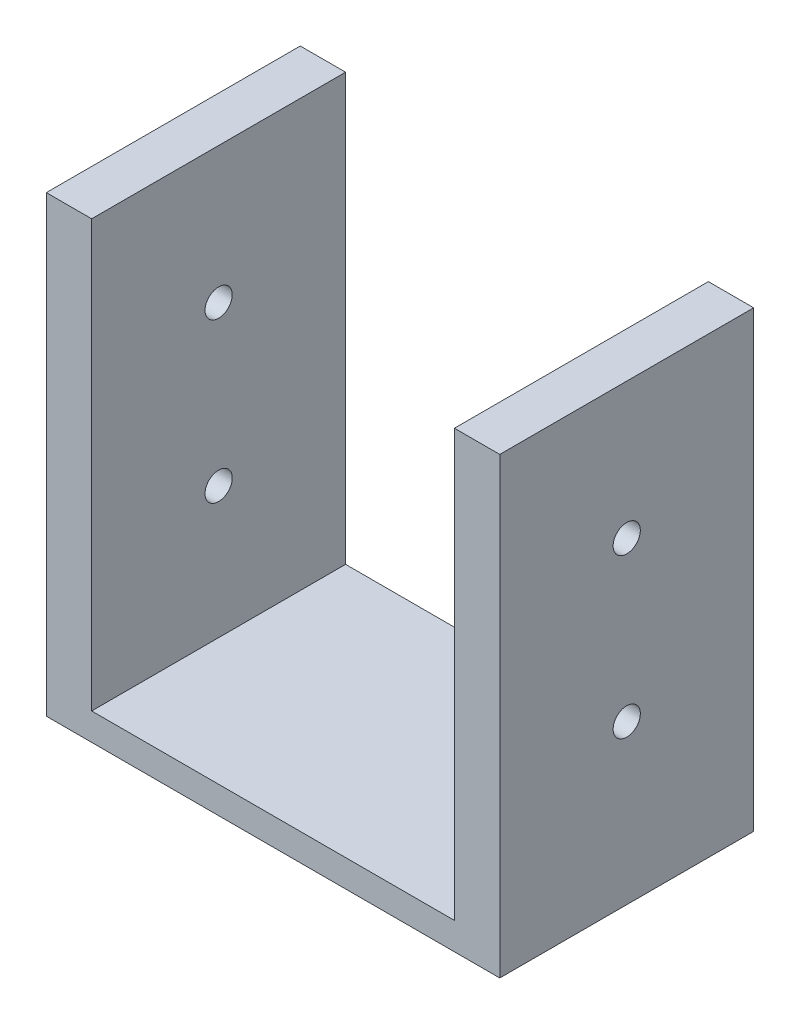
ISO-10303-21;
HEADER;
FILE_DESCRIPTION(('STEP AP214'),'2;1');
FILE_NAME('part.step','',(''),(''),'','','');
FILE_SCHEMA(('AUTOMOTIVE_DESIGN { 1 0 10303 214 1 1 1 1 }'));
ENDSEC;
DATA;
#1=APPLICATION_CONTEXT('core data for automotive mechanical design processes');
#2=APPLICATION_PROTOCOL_DEFINITION('international standard','automotive_design',2000,#1);
#3=PRODUCT_CONTEXT('',#1,'mechanical');
#4=PRODUCT('Part','Part','',(#3));
#5=PRODUCT_RELATED_PRODUCT_CATEGORY('part','',(#4));
#6=PRODUCT_DEFINITION_FORMATION('','',#4);
#7=PRODUCT_DEFINITION_CONTEXT('part definition',#1,'design');
#8=PRODUCT_DEFINITION('design','',#6,#7);
#9=PRODUCT_DEFINITION_SHAPE('','',#8);
#10=(LENGTH_UNIT() NAMED_UNIT(*) SI_UNIT(.MILLI.,.METRE.));
#11=(NAMED_UNIT(*) PLANE_ANGLE_UNIT() SI_UNIT($,.RADIAN.));
#12=(NAMED_UNIT(*) SI_UNIT($,.STERADIAN.) SOLID_ANGLE_UNIT());
#13=UNCERTAINTY_MEASURE_WITH_UNIT(LENGTH_MEASURE(1.E-05),#10,'distance_accuracy_value','');
#14=(GEOMETRIC_REPRESENTATION_CONTEXT(3) GLOBAL_UNCERTAINTY_ASSIGNED_CONTEXT((#13)) GLOBAL_UNIT_ASSIGNED_CONTEXT((#10,
#11,#12)) REPRESENTATION_CONTEXT('',''));
#15=CARTESIAN_POINT('',(0.,0.,0.));
#16=DIRECTION('',(0.,0.,1.));
#17=DIRECTION('',(1.,0.,0.));
#18=AXIS2_PLACEMENT_3D('',#15,#16,#17);
#19=CARTESIAN_POINT('',(0.,3.,0.));
#20=DIRECTION('',(0.,1.,0.));
#21=DIRECTION('',(0.,0.,1.));
#22=AXIS2_PLACEMENT_3D('',#19,#20,#21);
#23=PLANE('',#22);
#24=DIRECTION('',(1.,0.,0.));
#25=VECTOR('',#24,1.);
#26=CARTESIAN_POINT('',(0.,3.,14.));
#27=LINE('',#26,#25);
#28=CARTESIAN_POINT('',(-20.,3.,14.));
#29=VERTEX_POINT('',#28);
#30=CARTESIAN_POINT('',(20.,3.,14.));
#31=VERTEX_POINT('',#30);
#32=EDGE_CURVE('E67',#29,#31,#27,.T.);
#33=ORIENTED_EDGE('',*,*,#32,.T.);
#34=DIRECTION('',(0.,0.,1.));
#35=VECTOR('',#34,1.);
#36=CARTESIAN_POINT('',(20.,3.,14.));
#37=LINE('',#36,#35);
#38=CARTESIAN_POINT('',(20.,3.,-14.));
#39=VERTEX_POINT('',#38);
#40=EDGE_CURVE('E62',#39,#31,#37,.T.);
#41=ORIENTED_EDGE('',*,*,#40,.F.);
#42=DIRECTION('',(1.,0.,0.));
#43=VECTOR('',#42,1.);
#44=CARTESIAN_POINT('',(0.,3.,-14.));
#45=LINE('',#44,#43);
#46=CARTESIAN_POINT('',(-20.,3.,-14.));
#47=VERTEX_POINT('',#46);
#48=EDGE_CURVE('E168',#47,#39,#45,.T.);
#49=ORIENTED_EDGE('',*,*,#48,.F.);
#50=DIRECTION('',(0.,0.,-1.));
#51=VECTOR('',#50,1.);
#52=CARTESIAN_POINT('',(-20.,3.,-14.));
#53=LINE('',#52,#51);
#54=EDGE_CURVE('E136',#29,#47,#53,.T.);
#55=ORIENTED_EDGE('',*,*,#54,.F.);
#56=EDGE_LOOP('',(#33,#41,#49,#55));
#57=FACE_BOUND('',#56,.T.);
#58=ADVANCED_FACE('F44',(#57),#23,.T.);
#59=CARTESIAN_POINT('',(0.,3.,14.));
#60=DIRECTION('',(0.,0.,-1.));
#61=DIRECTION('',(-1.,0.,0.));
#62=AXIS2_PLACEMENT_3D('',#59,#60,#61);
#63=PLANE('',#62);
#64=DIRECTION('',(1.,0.,0.));
#65=VECTOR('',#64,1.);
#66=CARTESIAN_POINT('',(0.,0.,14.));
#67=LINE('',#66,#65);
#68=CARTESIAN_POINT('',(-25.,0.,14.));
#69=VERTEX_POINT('',#68);
#70=CARTESIAN_POINT('',(25.,0.,14.));
#71=VERTEX_POINT('',#70);
#72=EDGE_CURVE('E114',#69,#71,#67,.T.);
#73=ORIENTED_EDGE('',*,*,#72,.T.);
#74=DIRECTION('',(0.,-1.,0.));
#75=VECTOR('',#74,1.);
#76=CARTESIAN_POINT('',(25.,3.,14.));
#77=LINE('',#76,#75);
#78=CARTESIAN_POINT('',(25.,50.,14.));
#79=VERTEX_POINT('',#78);
#80=EDGE_CURVE('E11',#79,#71,#77,.T.);
#81=ORIENTED_EDGE('',*,*,#80,.F.);
#82=DIRECTION('',(1.,0.,0.));
#83=VECTOR('',#82,1.);
#84=CARTESIAN_POINT('',(25.,50.,14.));
#85=LINE('',#84,#83);
#86=CARTESIAN_POINT('',(20.,50.,14.));
#87=VERTEX_POINT('',#86);
#88=EDGE_CURVE('E111',#87,#79,#85,.T.);
#89=ORIENTED_EDGE('',*,*,#88,.F.);
#90=DIRECTION('',(0.,-1.,0.));
#91=VECTOR('',#90,1.);
#92=CARTESIAN_POINT('',(20.,50.,14.));
#93=LINE('',#92,#91);
#94=EDGE_CURVE('E127',#87,#31,#93,.T.);
#95=ORIENTED_EDGE('',*,*,#94,.T.);
#96=ORIENTED_EDGE('',*,*,#32,.F.);
#97=DIRECTION('',(0.,-1.,0.));
#98=VECTOR('',#97,1.);
#99=CARTESIAN_POINT('',(-20.,50.,14.));
#100=LINE('',#99,#98);
#101=CARTESIAN_POINT('',(-20.,50.,14.));
#102=VERTEX_POINT('',#101);
#103=EDGE_CURVE('E162',#102,#29,#100,.T.);
#104=ORIENTED_EDGE('',*,*,#103,.F.);
#105=DIRECTION('',(1.,0.,0.));
#106=VECTOR('',#105,1.);
#107=CARTESIAN_POINT('',(-25.,50.,14.));
#108=LINE('',#107,#106);
#109=CARTESIAN_POINT('',(-25.,50.,14.));
#110=VERTEX_POINT('',#109);
#111=EDGE_CURVE('E145',#110,#102,#108,.T.);
#112=ORIENTED_EDGE('',*,*,#111,.F.);
#113=DIRECTION('',(0.,-1.,0.));
#114=VECTOR('',#113,1.);
#115=CARTESIAN_POINT('',(-25.,3.,14.));
#116=LINE('',#115,#114);
#117=EDGE_CURVE('E172',#110,#69,#116,.T.);
#118=ORIENTED_EDGE('',*,*,#117,.T.);
#119=EDGE_LOOP('',(#73,#81,#89,#95,#96,#104,#112,#118));
#120=FACE_BOUND('',#119,.T.);
#121=ADVANCED_FACE('F46',(#120),#63,.F.);
#122=CARTESIAN_POINT('',(25.,3.,0.));
#123=DIRECTION('',(1.,0.,0.));
#124=DIRECTION('',(0.,0.,-1.));
#125=AXIS2_PLACEMENT_3D('',#122,#123,#124);
#126=PLANE('',#125);
#127=CARTESIAN_POINT('',(25.,17.5,0.));
#128=DIRECTION('',(1.,0.,0.));
#129=DIRECTION('',(0.,0.,-1.));
#130=AXIS2_PLACEMENT_3D('',#127,#128,#129);
#131=CIRCLE('',#130,1.5);
#132=CARTESIAN_POINT('',(25.,17.5,-1.50000000000001));
#133=VERTEX_POINT('',#132);
#134=EDGE_CURVE('E202',#133,#133,#131,.T.);
#135=ORIENTED_EDGE('',*,*,#134,.F.);
#136=EDGE_LOOP('',(#135));
#137=FACE_BOUND('',#136,.T.);
#138=CARTESIAN_POINT('',(25.,35.,0.));
#139=DIRECTION('',(1.,0.,0.));
#140=DIRECTION('',(0.,0.,-1.));
#141=AXIS2_PLACEMENT_3D('',#138,#139,#140);
#142=CIRCLE('',#141,1.5);
#143=CARTESIAN_POINT('',(25.,35.,-1.50000000000001));
#144=VERTEX_POINT('',#143);
#145=EDGE_CURVE('E208',#144,#144,#142,.T.);
#146=ORIENTED_EDGE('',*,*,#145,.F.);
#147=EDGE_LOOP('',(#146));
#148=FACE_BOUND('',#147,.T.);
#149=DIRECTION('',(0.,0.,1.));
#150=VECTOR('',#149,1.);
#151=CARTESIAN_POINT('',(25.,0.,0.));
#152=LINE('',#151,#150);
#153=CARTESIAN_POINT('',(25.,0.,-14.));
#154=VERTEX_POINT('',#153);
#155=EDGE_CURVE('E175',#154,#71,#152,.T.);
#156=ORIENTED_EDGE('',*,*,#155,.F.);
#157=DIRECTION('',(0.,-1.,0.));
#158=VECTOR('',#157,1.);
#159=CARTESIAN_POINT('',(25.,3.,-14.));
#160=LINE('',#159,#158);
#161=CARTESIAN_POINT('',(25.,50.,-14.));
#162=VERTEX_POINT('',#161);
#163=EDGE_CURVE('E54',#162,#154,#160,.T.);
#164=ORIENTED_EDGE('',*,*,#163,.F.);
#165=DIRECTION('',(0.,0.,-1.));
#166=VECTOR('',#165,1.);
#167=CARTESIAN_POINT('',(25.,50.,14.));
#168=LINE('',#167,#166);
#169=EDGE_CURVE('E122',#79,#162,#168,.T.);
#170=ORIENTED_EDGE('',*,*,#169,.F.);
#171=ORIENTED_EDGE('',*,*,#80,.T.);
#172=EDGE_LOOP('',(#156,#164,#170,#171));
#173=FACE_BOUND('',#172,.T.);
#174=ADVANCED_FACE('F129',(#137,#148,#173),#126,.T.);
#175=CARTESIAN_POINT('',(0.,3.,-14.));
#176=DIRECTION('',(0.,0.,-1.));
#177=DIRECTION('',(-1.,0.,0.));
#178=AXIS2_PLACEMENT_3D('',#175,#176,#177);
#179=PLANE('',#178);
#180=DIRECTION('',(1.,0.,0.));
#181=VECTOR('',#180,1.);
#182=CARTESIAN_POINT('',(0.,0.,-14.));
#183=LINE('',#182,#181);
#184=CARTESIAN_POINT('',(-25.,0.,-14.));
#185=VERTEX_POINT('',#184);
#186=EDGE_CURVE('E178',#185,#154,#183,.T.);
#187=ORIENTED_EDGE('',*,*,#186,.F.);
#188=DIRECTION('',(0.,-1.,0.));
#189=VECTOR('',#188,1.);
#190=CARTESIAN_POINT('',(-25.,3.,-14.));
#191=LINE('',#190,#189);
#192=CARTESIAN_POINT('',(-25.,50.,-14.));
#193=VERTEX_POINT('',#192);
#194=EDGE_CURVE('E186',#193,#185,#191,.T.);
#195=ORIENTED_EDGE('',*,*,#194,.F.);
#196=DIRECTION('',(-1.,0.,0.));
#197=VECTOR('',#196,1.);
#198=CARTESIAN_POINT('',(-25.,50.,-14.));
#199=LINE('',#198,#197);
#200=CARTESIAN_POINT('',(-20.,50.,-14.));
#201=VERTEX_POINT('',#200);
#202=EDGE_CURVE('E151',#201,#193,#199,.T.);
#203=ORIENTED_EDGE('',*,*,#202,.F.);
#204=DIRECTION('',(0.,-1.,0.));
#205=VECTOR('',#204,1.);
#206=CARTESIAN_POINT('',(-20.,50.,-14.));
#207=LINE('',#206,#205);
#208=EDGE_CURVE('E155',#201,#47,#207,.T.);
#209=ORIENTED_EDGE('',*,*,#208,.T.);
#210=ORIENTED_EDGE('',*,*,#48,.T.);
#211=DIRECTION('',(0.,-1.,0.));
#212=VECTOR('',#211,1.);
#213=CARTESIAN_POINT('',(20.,50.,-14.));
#214=LINE('',#213,#212);
#215=CARTESIAN_POINT('',(20.,50.,-14.));
#216=VERTEX_POINT('',#215);
#217=EDGE_CURVE('E222',#216,#39,#214,.T.);
#218=ORIENTED_EDGE('',*,*,#217,.F.);
#219=DIRECTION('',(-1.,0.,0.));
#220=VECTOR('',#219,1.);
#221=CARTESIAN_POINT('',(25.,50.,-14.));
#222=LINE('',#221,#220);
#223=EDGE_CURVE('E132',#162,#216,#222,.T.);
#224=ORIENTED_EDGE('',*,*,#223,.F.);
#225=ORIENTED_EDGE('',*,*,#163,.T.);
#226=EDGE_LOOP('',(#187,#195,#203,#209,#210,#218,#224,#225));
#227=FACE_BOUND('',#226,.T.);
#228=ADVANCED_FACE('F266',(#227),#179,.T.);
#229=CARTESIAN_POINT('',(-25.,3.,0.));
#230=DIRECTION('',(1.,0.,0.));
#231=DIRECTION('',(0.,0.,-1.));
#232=AXIS2_PLACEMENT_3D('',#229,#230,#231);
#233=PLANE('',#232);
#234=CARTESIAN_POINT('',(-25.,17.5,0.));
#235=DIRECTION('',(1.,0.,0.));
#236=DIRECTION('',(0.,0.,-1.));
#237=AXIS2_PLACEMENT_3D('',#234,#235,#236);
#238=CIRCLE('',#237,1.5);
#239=CARTESIAN_POINT('',(-25.,17.5,-1.5));
#240=VERTEX_POINT('',#239);
#241=EDGE_CURVE('E194',#240,#240,#238,.T.);
#242=ORIENTED_EDGE('',*,*,#241,.T.);
#243=EDGE_LOOP('',(#242));
#244=FACE_BOUND('',#243,.T.);
#245=CARTESIAN_POINT('',(-25.,35.,0.));
#246=DIRECTION('',(1.,0.,0.));
#247=DIRECTION('',(0.,0.,-1.));
#248=AXIS2_PLACEMENT_3D('',#245,#246,#247);
#249=CIRCLE('',#248,1.5);
#250=CARTESIAN_POINT('',(-25.,35.,-1.49999999999999));
#251=VERTEX_POINT('',#250);
#252=EDGE_CURVE('E214',#251,#251,#249,.T.);
#253=ORIENTED_EDGE('',*,*,#252,.T.);
#254=EDGE_LOOP('',(#253));
#255=FACE_BOUND('',#254,.T.);
#256=DIRECTION('',(0.,0.,1.));
#257=VECTOR('',#256,1.);
#258=CARTESIAN_POINT('',(-25.,0.,0.));
#259=LINE('',#258,#257);
#260=EDGE_CURVE('E169',#185,#69,#259,.T.);
#261=ORIENTED_EDGE('',*,*,#260,.T.);
#262=ORIENTED_EDGE('',*,*,#117,.F.);
#263=DIRECTION('',(0.,0.,1.));
#264=VECTOR('',#263,1.);
#265=CARTESIAN_POINT('',(-25.,50.,-14.));
#266=LINE('',#265,#264);
#267=EDGE_CURVE('E141',#193,#110,#266,.T.);
#268=ORIENTED_EDGE('',*,*,#267,.F.);
#269=ORIENTED_EDGE('',*,*,#194,.T.);
#270=EDGE_LOOP('',(#261,#262,#268,#269));
#271=FACE_BOUND('',#270,.T.);
#272=ADVANCED_FACE('F262',(#244,#255,#271),#233,.F.);
#273=CARTESIAN_POINT('',(0.,0.,0.));
#274=DIRECTION('',(0.,1.,0.));
#275=DIRECTION('',(0.,0.,1.));
#276=AXIS2_PLACEMENT_3D('',#273,#274,#275);
#277=PLANE('',#276);
#278=ORIENTED_EDGE('',*,*,#72,.F.);
#279=ORIENTED_EDGE('',*,*,#260,.F.);
#280=ORIENTED_EDGE('',*,*,#186,.T.);
#281=ORIENTED_EDGE('',*,*,#155,.T.);
#282=EDGE_LOOP('',(#278,#279,#280,#281));
#283=FACE_BOUND('',#282,.T.);
#284=ADVANCED_FACE('F259',(#283),#277,.F.);
#285=CARTESIAN_POINT('',(-20.,50.,-14.));
#286=DIRECTION('',(-1.,0.,0.));
#287=DIRECTION('',(0.,0.,1.));
#288=AXIS2_PLACEMENT_3D('',#285,#286,#287);
#289=PLANE('',#288);
#290=CARTESIAN_POINT('',(-20.,17.5,0.));
#291=DIRECTION('',(-1.,0.,0.));
#292=DIRECTION('',(0.,0.,1.));
#293=AXIS2_PLACEMENT_3D('',#290,#291,#292);
#294=CIRCLE('',#293,1.5);
#295=CARTESIAN_POINT('',(-20.,17.5,1.50000000000001));
#296=VERTEX_POINT('',#295);
#297=EDGE_CURVE('E218',#296,#296,#294,.T.);
#298=ORIENTED_EDGE('',*,*,#297,.T.);
#299=EDGE_LOOP('',(#298));
#300=FACE_BOUND('',#299,.T.);
#301=CARTESIAN_POINT('',(-20.,35.,0.));
#302=DIRECTION('',(-1.,0.,0.));
#303=DIRECTION('',(0.,0.,1.));
#304=AXIS2_PLACEMENT_3D('',#301,#302,#303);
#305=CIRCLE('',#304,1.5);
#306=CARTESIAN_POINT('',(-20.,35.,1.50000000000001));
#307=VERTEX_POINT('',#306);
#308=EDGE_CURVE('E193',#307,#307,#305,.T.);
#309=ORIENTED_EDGE('',*,*,#308,.T.);
#310=EDGE_LOOP('',(#309));
#311=FACE_BOUND('',#310,.T.);
#312=ORIENTED_EDGE('',*,*,#54,.T.);
#313=ORIENTED_EDGE('',*,*,#208,.F.);
#314=DIRECTION('',(0.,0.,-1.));
#315=VECTOR('',#314,1.);
#316=CARTESIAN_POINT('',(-20.,50.,-14.));
#317=LINE('',#316,#315);
#318=EDGE_CURVE('E148',#102,#201,#317,.T.);
#319=ORIENTED_EDGE('',*,*,#318,.F.);
#320=ORIENTED_EDGE('',*,*,#103,.T.);
#321=EDGE_LOOP('',(#312,#313,#319,#320));
#322=FACE_BOUND('',#321,.T.);
#323=ADVANCED_FACE('F257',(#300,#311,#322),#289,.F.);
#324=CARTESIAN_POINT('',(0.,50.,0.));
#325=DIRECTION('',(0.,1.,0.));
#326=DIRECTION('',(0.,0.,1.));
#327=AXIS2_PLACEMENT_3D('',#324,#325,#326);
#328=PLANE('',#327);
#329=ORIENTED_EDGE('',*,*,#267,.T.);
#330=ORIENTED_EDGE('',*,*,#111,.T.);
#331=ORIENTED_EDGE('',*,*,#318,.T.);
#332=ORIENTED_EDGE('',*,*,#202,.T.);
#333=EDGE_LOOP('',(#329,#330,#331,#332));
#334=FACE_BOUND('',#333,.T.);
#335=ADVANCED_FACE('F292',(#334),#328,.T.);
#336=CARTESIAN_POINT('',(20.,50.,14.));
#337=DIRECTION('',(1.,0.,0.));
#338=DIRECTION('',(0.,0.,-1.));
#339=AXIS2_PLACEMENT_3D('',#336,#337,#338);
#340=PLANE('',#339);
#341=CARTESIAN_POINT('',(20.,17.5,0.));
#342=DIRECTION('',(1.,0.,0.));
#343=DIRECTION('',(0.,0.,-1.));
#344=AXIS2_PLACEMENT_3D('',#341,#342,#343);
#345=CIRCLE('',#344,1.5);
#346=CARTESIAN_POINT('',(20.,17.5,-1.50000000000001));
#347=VERTEX_POINT('',#346);
#348=EDGE_CURVE('E48',#347,#347,#345,.T.);
#349=ORIENTED_EDGE('',*,*,#348,.T.);
#350=EDGE_LOOP('',(#349));
#351=FACE_BOUND('',#350,.T.);
#352=CARTESIAN_POINT('',(20.,35.,0.));
#353=DIRECTION('',(1.,0.,0.));
#354=DIRECTION('',(0.,0.,-1.));
#355=AXIS2_PLACEMENT_3D('',#352,#353,#354);
#356=CIRCLE('',#355,1.5);
#357=CARTESIAN_POINT('',(20.,35.,-1.50000000000001));
#358=VERTEX_POINT('',#357);
#359=EDGE_CURVE('E190',#358,#358,#356,.T.);
#360=ORIENTED_EDGE('',*,*,#359,.T.);
#361=EDGE_LOOP('',(#360));
#362=FACE_BOUND('',#361,.T.);
#363=ORIENTED_EDGE('',*,*,#40,.T.);
#364=ORIENTED_EDGE('',*,*,#94,.F.);
#365=DIRECTION('',(0.,0.,1.));
#366=VECTOR('',#365,1.);
#367=CARTESIAN_POINT('',(20.,50.,14.));
#368=LINE('',#367,#366);
#369=EDGE_CURVE('E124',#216,#87,#368,.T.);
#370=ORIENTED_EDGE('',*,*,#369,.F.);
#371=ORIENTED_EDGE('',*,*,#217,.T.);
#372=EDGE_LOOP('',(#363,#364,#370,#371));
#373=FACE_BOUND('',#372,.T.);
#374=ADVANCED_FACE('F232',(#351,#362,#373),#340,.F.);
#375=CARTESIAN_POINT('',(0.,50.,0.));
#376=DIRECTION('',(0.,1.,0.));
#377=DIRECTION('',(0.,0.,1.));
#378=AXIS2_PLACEMENT_3D('',#375,#376,#377);
#379=PLANE('',#378);
#380=ORIENTED_EDGE('',*,*,#169,.T.);
#381=ORIENTED_EDGE('',*,*,#223,.T.);
#382=ORIENTED_EDGE('',*,*,#369,.T.);
#383=ORIENTED_EDGE('',*,*,#88,.T.);
#384=EDGE_LOOP('',(#380,#381,#382,#383));
#385=FACE_BOUND('',#384,.T.);
#386=ADVANCED_FACE('F121',(#385),#379,.T.);
#387=CARTESIAN_POINT('',(-25.,35.,0.));
#388=DIRECTION('',(1.,0.,0.));
#389=DIRECTION('',(0.,0.,-1.));
#390=AXIS2_PLACEMENT_3D('',#387,#388,#389);
#391=CYLINDRICAL_SURFACE('',#390,1.5);
#392=ORIENTED_EDGE('',*,*,#145,.T.);
#393=EDGE_LOOP('',(#392));
#394=FACE_BOUND('',#393,.T.);
#395=ORIENTED_EDGE('',*,*,#359,.F.);
#396=EDGE_LOOP('',(#395));
#397=FACE_BOUND('',#396,.T.);
#398=ADVANCED_FACE('F237',(#394,#397),#391,.F.);
#399=CARTESIAN_POINT('',(-25.,17.5,0.));
#400=DIRECTION('',(1.,0.,0.));
#401=DIRECTION('',(0.,0.,-1.));
#402=AXIS2_PLACEMENT_3D('',#399,#400,#401);
#403=CYLINDRICAL_SURFACE('',#402,1.5);
#404=ORIENTED_EDGE('',*,*,#134,.T.);
#405=EDGE_LOOP('',(#404));
#406=FACE_BOUND('',#405,.T.);
#407=ORIENTED_EDGE('',*,*,#348,.F.);
#408=EDGE_LOOP('',(#407));
#409=FACE_BOUND('',#408,.T.);
#410=ADVANCED_FACE('F234',(#406,#409),#403,.F.);
#411=ORIENTED_EDGE('',*,*,#252,.F.);
#412=EDGE_LOOP('',(#411));
#413=FACE_BOUND('',#412,.T.);
#414=ORIENTED_EDGE('',*,*,#308,.F.);
#415=EDGE_LOOP('',(#414));
#416=FACE_BOUND('',#415,.T.);
#417=ADVANCED_FACE('F236',(#413,#416),#391,.F.);
#418=ORIENTED_EDGE('',*,*,#241,.F.);
#419=EDGE_LOOP('',(#418));
#420=FACE_BOUND('',#419,.T.);
#421=ORIENTED_EDGE('',*,*,#297,.F.);
#422=EDGE_LOOP('',(#421));
#423=FACE_BOUND('',#422,.T.);
#424=ADVANCED_FACE('F240',(#420,#423),#403,.F.);
#425=CLOSED_SHELL('',(#58,#121,#174,#228,#272,#284,#323,#335,#374,#386,#398,#410,#417,#424));
#426=MANIFOLD_SOLID_BREP('B2',#425);
#427=ADVANCED_BREP_SHAPE_REPRESENTATION('',(#18,#426),#14);
#428=SHAPE_DEFINITION_REPRESENTATION(#9,#427);
ENDSEC;
END-ISO-10303-21;
